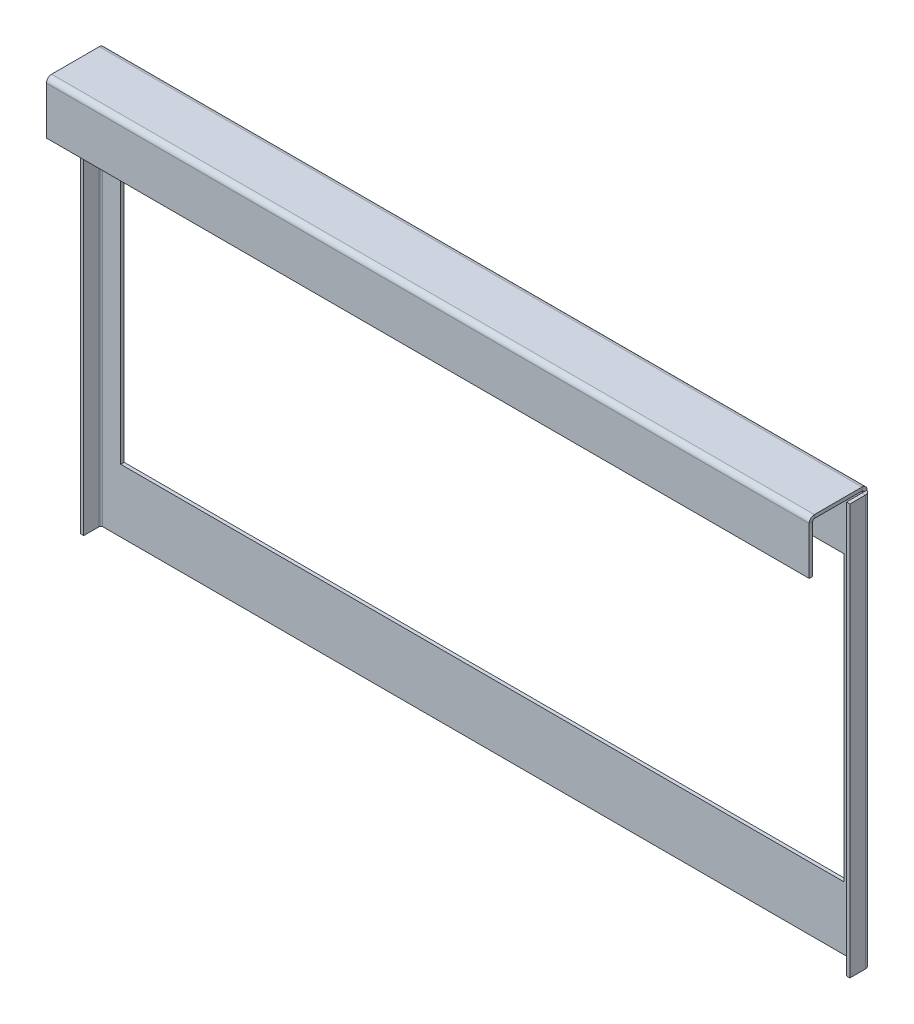
ISO-10303-21;
HEADER;
FILE_DESCRIPTION(('STEP AP214'),'2;1');
FILE_NAME('part.step','',(''),(''),'','','');
FILE_SCHEMA(('AUTOMOTIVE_DESIGN { 1 0 10303 214 1 1 1 1 }'));
ENDSEC;
DATA;
#1=APPLICATION_CONTEXT('core data for automotive mechanical design processes');
#2=APPLICATION_PROTOCOL_DEFINITION('international standard','automotive_design',2000,#1);
#3=PRODUCT_CONTEXT('',#1,'mechanical');
#4=PRODUCT('Part','Part','',(#3));
#5=PRODUCT_RELATED_PRODUCT_CATEGORY('part','',(#4));
#6=PRODUCT_DEFINITION_FORMATION('','',#4);
#7=PRODUCT_DEFINITION_CONTEXT('part definition',#1,'design');
#8=PRODUCT_DEFINITION('design','',#6,#7);
#9=PRODUCT_DEFINITION_SHAPE('','',#8);
#10=(LENGTH_UNIT() NAMED_UNIT(*) SI_UNIT(.MILLI.,.METRE.));
#11=(NAMED_UNIT(*) PLANE_ANGLE_UNIT() SI_UNIT($,.RADIAN.));
#12=(NAMED_UNIT(*) SI_UNIT($,.STERADIAN.) SOLID_ANGLE_UNIT());
#13=UNCERTAINTY_MEASURE_WITH_UNIT(LENGTH_MEASURE(1.E-05),#10,'distance_accuracy_value','');
#14=(GEOMETRIC_REPRESENTATION_CONTEXT(3) GLOBAL_UNCERTAINTY_ASSIGNED_CONTEXT((#13)) GLOBAL_UNIT_ASSIGNED_CONTEXT((#10,
#11,#12)) REPRESENTATION_CONTEXT('',''));
#15=CARTESIAN_POINT('',(0.,0.,0.));
#16=DIRECTION('',(0.,0.,1.));
#17=DIRECTION('',(1.,0.,0.));
#18=AXIS2_PLACEMENT_3D('',#15,#16,#17);
#19=CARTESIAN_POINT('',(221.5,88.4292036732051,0.));
#20=DIRECTION('',(0.,-1.,0.));
#21=DIRECTION('',(0.,0.,-1.));
#22=AXIS2_PLACEMENT_3D('',#19,#20,#21);
#23=PLANE('',#22);
#24=DIRECTION('',(0.,0.,1.));
#25=VECTOR('',#24,1.);
#26=CARTESIAN_POINT('',(221.5,88.4292036732051,-2.00000000000043));
#27=LINE('',#26,#25);
#28=CARTESIAN_POINT('',(221.5,88.4292036732051,-2.));
#29=VERTEX_POINT('',#28);
#30=CARTESIAN_POINT('',(221.5,88.4292036732051,-1.82842712474622));
#31=VERTEX_POINT('',#30);
#32=EDGE_CURVE('E513',#29,#31,#27,.T.);
#33=ORIENTED_EDGE('',*,*,#32,.T.);
#34=CARTESIAN_POINT('',(220.5,88.4292036732051,1.00000000000001));
#35=DIRECTION('',(0.,1.,0.));
#36=DIRECTION('',(0.,0.,1.));
#37=AXIS2_PLACEMENT_3D('',#34,#35,#36);
#38=CIRCLE('',#37,3.00000000000003);
#39=CARTESIAN_POINT('',(220.5,88.4292036732051,-2.));
#40=VERTEX_POINT('',#39);
#41=EDGE_CURVE('E12',#31,#40,#38,.T.);
#42=ORIENTED_EDGE('',*,*,#41,.T.);
#43=DIRECTION('',(-1.,0.,0.));
#44=VECTOR('',#43,1.);
#45=CARTESIAN_POINT('',(0.,88.4292036732051,-2.));
#46=LINE('',#45,#44);
#47=EDGE_CURVE('E522',#29,#40,#46,.T.);
#48=ORIENTED_EDGE('',*,*,#47,.F.);
#49=EDGE_LOOP('',(#33,#42,#48));
#50=FACE_BOUND('',#49,.T.);
#51=ADVANCED_FACE('F46',(#50),#23,.T.);
#52=CARTESIAN_POINT('',(0.,0.,-2.));
#53=DIRECTION('',(0.,0.,1.));
#54=DIRECTION('',(1.,0.,0.));
#55=AXIS2_PLACEMENT_3D('',#52,#53,#54);
#56=PLANE('',#55);
#57=DIRECTION('',(1.,0.,0.));
#58=VECTOR('',#57,1.);
#59=CARTESIAN_POINT('',(-210.,-113.364518484025,-2.00000000000002));
#60=LINE('',#59,#58);
#61=CARTESIAN_POINT('',(-210.,-113.364518484025,-2.00000000000002));
#62=VERTEX_POINT('',#61);
#63=CARTESIAN_POINT('',(210.,-113.364518484025,-2.00000000000002));
#64=VERTEX_POINT('',#63);
#65=EDGE_CURVE('E237',#62,#64,#60,.T.);
#66=ORIENTED_EDGE('',*,*,#65,.T.);
#67=DIRECTION('',(0.,1.,0.));
#68=VECTOR('',#67,1.);
#69=CARTESIAN_POINT('',(210.,51.6354815159748,-2.00000000000002));
#70=LINE('',#69,#68);
#71=CARTESIAN_POINT('',(210.,51.6354815159748,-2.00000000000002));
#72=VERTEX_POINT('',#71);
#73=EDGE_CURVE('E230',#64,#72,#70,.T.);
#74=ORIENTED_EDGE('',*,*,#73,.T.);
#75=DIRECTION('',(-1.,0.,0.));
#76=VECTOR('',#75,1.);
#77=CARTESIAN_POINT('',(-210.,51.6354815159748,-2.00000000000002));
#78=LINE('',#77,#76);
#79=CARTESIAN_POINT('',(-210.,51.6354815159748,-2.));
#80=VERTEX_POINT('',#79);
#81=EDGE_CURVE('E240',#72,#80,#78,.T.);
#82=ORIENTED_EDGE('',*,*,#81,.T.);
#83=DIRECTION('',(0.,-1.,0.));
#84=VECTOR('',#83,1.);
#85=CARTESIAN_POINT('',(-210.,51.6354815159748,-2.00000000000002));
#86=LINE('',#85,#84);
#87=EDGE_CURVE('E65',#80,#62,#86,.T.);
#88=ORIENTED_EDGE('',*,*,#87,.T.);
#89=EDGE_LOOP('',(#66,#74,#82,#88));
#90=FACE_BOUND('',#89,.T.);
#91=DIRECTION('',(0.,1.,0.));
#92=VECTOR('',#91,1.);
#93=CARTESIAN_POINT('',(220.5,88.4292036732051,-2.00000000000002));
#94=LINE('',#93,#92);
#95=CARTESIAN_POINT('',(220.5,-150.,-2.));
#96=VERTEX_POINT('',#95);
#97=EDGE_CURVE('E320',#40,#96,#94,.F.);
#98=ORIENTED_EDGE('',*,*,#97,.T.);
#99=DIRECTION('',(1.,0.,0.));
#100=VECTOR('',#99,1.);
#101=CARTESIAN_POINT('',(-221.5,-150.,-2.));
#102=LINE('',#101,#100);
#103=CARTESIAN_POINT('',(-220.5,-150.,-2.));
#104=VERTEX_POINT('',#103);
#105=EDGE_CURVE('E518',#104,#96,#102,.T.);
#106=ORIENTED_EDGE('',*,*,#105,.F.);
#107=DIRECTION('',(0.,-1.,0.));
#108=VECTOR('',#107,1.);
#109=CARTESIAN_POINT('',(-220.5,-150.,-1.99999999999999));
#110=LINE('',#109,#108);
#111=CARTESIAN_POINT('',(-220.5,88.4292036732051,-2.));
#112=VERTEX_POINT('',#111);
#113=EDGE_CURVE('E388',#104,#112,#110,.F.);
#114=ORIENTED_EDGE('',*,*,#113,.T.);
#115=EDGE_CURVE('E492',#40,#112,#46,.T.);
#116=ORIENTED_EDGE('',*,*,#115,.F.);
#117=EDGE_LOOP('',(#98,#106,#114,#116));
#118=FACE_BOUND('',#117,.T.);
#119=ADVANCED_FACE('F245',(#90,#118),#56,.F.);
#120=CARTESIAN_POINT('',(0.,0.,0.));
#121=DIRECTION('',(0.,0.,1.));
#122=DIRECTION('',(1.,0.,0.));
#123=AXIS2_PLACEMENT_3D('',#120,#121,#122);
#124=PLANE('',#123);
#125=DIRECTION('',(0.,1.,0.));
#126=VECTOR('',#125,1.);
#127=CARTESIAN_POINT('',(210.,51.6354815159748,0.));
#128=LINE('',#127,#126);
#129=CARTESIAN_POINT('',(210.,-113.364518484025,0.));
#130=VERTEX_POINT('',#129);
#131=CARTESIAN_POINT('',(210.,51.6354815159748,0.));
#132=VERTEX_POINT('',#131);
#133=EDGE_CURVE('E73',#130,#132,#128,.T.);
#134=ORIENTED_EDGE('',*,*,#133,.F.);
#135=DIRECTION('',(1.,0.,0.));
#136=VECTOR('',#135,1.);
#137=CARTESIAN_POINT('',(-210.,-113.364518484025,0.));
#138=LINE('',#137,#136);
#139=CARTESIAN_POINT('',(-210.,-113.364518484025,0.));
#140=VERTEX_POINT('',#139);
#141=EDGE_CURVE('E249',#140,#130,#138,.T.);
#142=ORIENTED_EDGE('',*,*,#141,.F.);
#143=DIRECTION('',(0.,-1.,0.));
#144=VECTOR('',#143,1.);
#145=CARTESIAN_POINT('',(-210.,51.6354815159748,0.));
#146=LINE('',#145,#144);
#147=CARTESIAN_POINT('',(-210.,51.6354815159748,0.));
#148=VERTEX_POINT('',#147);
#149=EDGE_CURVE('E254',#148,#140,#146,.T.);
#150=ORIENTED_EDGE('',*,*,#149,.F.);
#151=DIRECTION('',(-1.,0.,0.));
#152=VECTOR('',#151,1.);
#153=CARTESIAN_POINT('',(-210.,51.6354815159748,0.));
#154=LINE('',#153,#152);
#155=EDGE_CURVE('E263',#132,#148,#154,.T.);
#156=ORIENTED_EDGE('',*,*,#155,.F.);
#157=EDGE_LOOP('',(#134,#142,#150,#156));
#158=FACE_BOUND('',#157,.T.);
#159=DIRECTION('',(1.,0.,0.));
#160=VECTOR('',#159,1.);
#161=CARTESIAN_POINT('',(-221.5,-150.,0.));
#162=LINE('',#161,#160);
#163=CARTESIAN_POINT('',(-220.5,-150.,0.));
#164=VERTEX_POINT('',#163);
#165=CARTESIAN_POINT('',(220.5,-150.,0.));
#166=VERTEX_POINT('',#165);
#167=EDGE_CURVE('E504',#164,#166,#162,.T.);
#168=ORIENTED_EDGE('',*,*,#167,.T.);
#169=DIRECTION('',(0.,1.,0.));
#170=VECTOR('',#169,1.);
#171=CARTESIAN_POINT('',(220.5,88.4292036732051,0.));
#172=LINE('',#171,#170);
#173=CARTESIAN_POINT('',(220.5,88.4292036732051,0.));
#174=VERTEX_POINT('',#173);
#175=EDGE_CURVE('E334',#174,#166,#172,.F.);
#176=ORIENTED_EDGE('',*,*,#175,.F.);
#177=DIRECTION('',(-1.,0.,0.));
#178=VECTOR('',#177,1.);
#179=CARTESIAN_POINT('',(0.,88.4292036732051,0.));
#180=LINE('',#179,#178);
#181=CARTESIAN_POINT('',(-220.5,88.4292036732051,0.));
#182=VERTEX_POINT('',#181);
#183=EDGE_CURVE('E512',#174,#182,#180,.T.);
#184=ORIENTED_EDGE('',*,*,#183,.T.);
#185=DIRECTION('',(0.,-1.,0.));
#186=VECTOR('',#185,1.);
#187=CARTESIAN_POINT('',(-220.5,-150.,0.));
#188=LINE('',#187,#186);
#189=EDGE_CURVE('E406',#164,#182,#188,.F.);
#190=ORIENTED_EDGE('',*,*,#189,.F.);
#191=EDGE_LOOP('',(#168,#176,#184,#190));
#192=FACE_BOUND('',#191,.T.);
#193=ADVANCED_FACE('F720',(#158,#192),#124,.T.);
#194=CARTESIAN_POINT('',(-220.5,88.4292036732051,0.));
#195=DIRECTION('',(0.,-1.,0.));
#196=DIRECTION('',(0.,0.,-1.));
#197=AXIS2_PLACEMENT_3D('',#194,#195,#196);
#198=PLANE('',#197);
#199=DIRECTION('',(1.,0.,0.));
#200=VECTOR('',#199,1.);
#201=CARTESIAN_POINT('',(-443.015653904465,88.4292036732051,-2.));
#202=LINE('',#201,#200);
#203=CARTESIAN_POINT('',(-221.5,88.4292036732051,-2.));
#204=VERTEX_POINT('',#203);
#205=EDGE_CURVE('E419',#112,#204,#202,.F.);
#206=ORIENTED_EDGE('',*,*,#205,.F.);
#207=CARTESIAN_POINT('',(-220.5,88.4292036732051,1.00000000000001));
#208=DIRECTION('',(0.,-1.,0.));
#209=DIRECTION('',(0.,0.,-1.));
#210=AXIS2_PLACEMENT_3D('',#207,#208,#209);
#211=CIRCLE('',#210,3.);
#212=CARTESIAN_POINT('',(-221.5,88.4292036732051,-1.82842712474617));
#213=VERTEX_POINT('',#212);
#214=EDGE_CURVE('E394',#112,#213,#211,.F.);
#215=ORIENTED_EDGE('',*,*,#214,.T.);
#216=DIRECTION('',(0.,0.,-1.));
#217=VECTOR('',#216,1.);
#218=CARTESIAN_POINT('',(-221.5,88.4292036732051,-2.00000000000043));
#219=LINE('',#218,#217);
#220=EDGE_CURVE('E503',#213,#204,#219,.T.);
#221=ORIENTED_EDGE('',*,*,#220,.T.);
#222=EDGE_LOOP('',(#206,#215,#221));
#223=FACE_BOUND('',#222,.T.);
#224=ADVANCED_FACE('F627',(#223),#198,.T.);
#225=CARTESIAN_POINT('',(-221.5,-150.,-2.));
#226=DIRECTION('',(0.,-1.,0.));
#227=DIRECTION('',(0.,0.,-1.));
#228=AXIS2_PLACEMENT_3D('',#225,#226,#227);
#229=PLANE('',#228);
#230=DIRECTION('',(0.,0.,-1.));
#231=VECTOR('',#230,1.);
#232=CARTESIAN_POINT('',(220.5,-150.,0.));
#233=LINE('',#232,#231);
#234=EDGE_CURVE('E326',#166,#96,#233,.T.);
#235=ORIENTED_EDGE('',*,*,#234,.F.);
#236=ORIENTED_EDGE('',*,*,#167,.F.);
#237=DIRECTION('',(0.,0.,-1.));
#238=VECTOR('',#237,1.);
#239=CARTESIAN_POINT('',(-220.5,-150.,0.));
#240=LINE('',#239,#238);
#241=EDGE_CURVE('E398',#164,#104,#240,.T.);
#242=ORIENTED_EDGE('',*,*,#241,.T.);
#243=ORIENTED_EDGE('',*,*,#105,.T.);
#244=EDGE_LOOP('',(#235,#236,#242,#243));
#245=FACE_BOUND('',#244,.T.);
#246=ADVANCED_FACE('F831',(#245),#229,.T.);
#247=CARTESIAN_POINT('',(0.,91.4292036732054,-90.5707963267948));
#248=DIRECTION('',(0.,-1.,0.));
#249=DIRECTION('',(1.,0.,0.));
#250=AXIS2_PLACEMENT_3D('',#247,#248,#249);
#251=PLANE('',#250);
#252=DIRECTION('',(0.,0.,-1.));
#253=VECTOR('',#252,1.);
#254=CARTESIAN_POINT('',(-221.5,91.4292036732048,59.4292036732051));
#255=LINE('',#254,#253);
#256=CARTESIAN_POINT('',(-221.5,91.429203673205,28.6438055098077));
#257=VERTEX_POINT('',#256);
#258=CARTESIAN_POINT('',(-221.5,91.4292036732051,0.999999999999997));
#259=VERTEX_POINT('',#258);
#260=EDGE_CURVE('E50',#257,#259,#255,.T.);
#261=ORIENTED_EDGE('',*,*,#260,.F.);
#262=DIRECTION('',(1.,0.,0.));
#263=VECTOR('',#262,1.);
#264=CARTESIAN_POINT('',(0.,91.429203673205,28.6438055098077));
#265=LINE('',#264,#263);
#266=CARTESIAN_POINT('',(221.5,91.429203673205,28.6438055098077));
#267=VERTEX_POINT('',#266);
#268=EDGE_CURVE('E542',#257,#267,#265,.T.);
#269=ORIENTED_EDGE('',*,*,#268,.T.);
#270=DIRECTION('',(0.,0.,1.));
#271=VECTOR('',#270,1.);
#272=CARTESIAN_POINT('',(221.5,91.4292036732048,59.4292036732051));
#273=LINE('',#272,#271);
#274=CARTESIAN_POINT('',(221.5,91.4292036732051,1.00000000000001));
#275=VERTEX_POINT('',#274);
#276=EDGE_CURVE('E557',#275,#267,#273,.T.);
#277=ORIENTED_EDGE('',*,*,#276,.F.);
#278=DIRECTION('',(-1.,0.,0.));
#279=VECTOR('',#278,1.);
#280=CARTESIAN_POINT('',(0.,91.4292036732051,1.00000000000001));
#281=LINE('',#280,#279);
#282=EDGE_CURVE('E526',#275,#259,#281,.T.);
#283=ORIENTED_EDGE('',*,*,#282,.T.);
#284=EDGE_LOOP('',(#261,#269,#277,#283));
#285=FACE_BOUND('',#284,.T.);
#286=ADVANCED_FACE('F607',(#285),#251,.F.);
#287=CARTESIAN_POINT('',(221.5,91.4292036732048,59.4292036732051));
#288=DIRECTION('',(1.,0.,0.));
#289=DIRECTION('',(0.,0.,1.));
#290=AXIS2_PLACEMENT_3D('',#287,#288,#289);
#291=PLANE('',#290);
#292=DIRECTION('',(0.,1.,0.));
#293=VECTOR('',#292,1.);
#294=CARTESIAN_POINT('',(221.5,91.429203673205,28.6438055098077));
#295=LINE('',#294,#293);
#296=CARTESIAN_POINT('',(221.5,89.429203673205,28.6438055098077));
#297=VERTEX_POINT('',#296);
#298=EDGE_CURVE('E56',#297,#267,#295,.T.);
#299=ORIENTED_EDGE('',*,*,#298,.F.);
#300=DIRECTION('',(0.,0.,1.));
#301=VECTOR('',#300,1.);
#302=CARTESIAN_POINT('',(221.5,89.4292036732048,59.4292036732051));
#303=LINE('',#302,#301);
#304=CARTESIAN_POINT('',(221.5,89.4292036732051,0.999999999999987));
#305=VERTEX_POINT('',#304);
#306=EDGE_CURVE('E502',#305,#297,#303,.T.);
#307=ORIENTED_EDGE('',*,*,#306,.F.);
#308=DIRECTION('',(0.,-1.,0.));
#309=VECTOR('',#308,1.);
#310=CARTESIAN_POINT('',(221.5,91.4292036732054,1.00000000000001));
#311=LINE('',#310,#309);
#312=EDGE_CURVE('E530',#275,#305,#311,.T.);
#313=ORIENTED_EDGE('',*,*,#312,.F.);
#314=ORIENTED_EDGE('',*,*,#276,.T.);
#315=EDGE_LOOP('',(#299,#307,#313,#314));
#316=FACE_BOUND('',#315,.T.);
#317=ADVANCED_FACE('F48',(#316),#291,.T.);
#318=CARTESIAN_POINT('',(-221.5,91.4292036732048,59.4292036732051));
#319=DIRECTION('',(-1.,0.,0.));
#320=DIRECTION('',(0.,0.,-1.));
#321=AXIS2_PLACEMENT_3D('',#318,#319,#320);
#322=PLANE('',#321);
#323=DIRECTION('',(0.,-1.,0.));
#324=VECTOR('',#323,1.);
#325=CARTESIAN_POINT('',(-221.5,91.429203673205,28.6438055098077));
#326=LINE('',#325,#324);
#327=CARTESIAN_POINT('',(-221.5,89.429203673205,28.6438055098077));
#328=VERTEX_POINT('',#327);
#329=EDGE_CURVE('E546',#257,#328,#326,.T.);
#330=ORIENTED_EDGE('',*,*,#329,.F.);
#331=ORIENTED_EDGE('',*,*,#260,.T.);
#332=DIRECTION('',(0.,1.,0.));
#333=VECTOR('',#332,1.);
#334=CARTESIAN_POINT('',(-221.5,91.4292036732054,1.00000000000001));
#335=LINE('',#334,#333);
#336=CARTESIAN_POINT('',(-221.5,89.4292036732051,0.999999999999987));
#337=VERTEX_POINT('',#336);
#338=EDGE_CURVE('E538',#337,#259,#335,.T.);
#339=ORIENTED_EDGE('',*,*,#338,.F.);
#340=DIRECTION('',(0.,0.,-1.));
#341=VECTOR('',#340,1.);
#342=CARTESIAN_POINT('',(-221.5,89.4292036732048,59.4292036732051));
#343=LINE('',#342,#341);
#344=EDGE_CURVE('E560',#328,#337,#343,.T.);
#345=ORIENTED_EDGE('',*,*,#344,.F.);
#346=EDGE_LOOP('',(#330,#331,#339,#345));
#347=FACE_BOUND('',#346,.T.);
#348=ADVANCED_FACE('F571',(#347),#322,.T.);
#349=CARTESIAN_POINT('',(0.,89.4292036732054,-90.5707963267948));
#350=DIRECTION('',(0.,-1.,0.));
#351=DIRECTION('',(1.,0.,0.));
#352=AXIS2_PLACEMENT_3D('',#349,#350,#351);
#353=PLANE('',#352);
#354=DIRECTION('',(1.,0.,0.));
#355=VECTOR('',#354,1.);
#356=CARTESIAN_POINT('',(0.,89.429203673205,28.6438055098077));
#357=LINE('',#356,#355);
#358=EDGE_CURVE('E550',#328,#297,#357,.T.);
#359=ORIENTED_EDGE('',*,*,#358,.F.);
#360=ORIENTED_EDGE('',*,*,#344,.T.);
#361=DIRECTION('',(-1.,0.,0.));
#362=VECTOR('',#361,1.);
#363=CARTESIAN_POINT('',(0.,89.4292036732051,0.999999999999987));
#364=LINE('',#363,#362);
#365=EDGE_CURVE('E534',#305,#337,#364,.T.);
#366=ORIENTED_EDGE('',*,*,#365,.F.);
#367=ORIENTED_EDGE('',*,*,#306,.T.);
#368=EDGE_LOOP('',(#359,#360,#366,#367));
#369=FACE_BOUND('',#368,.T.);
#370=ADVANCED_FACE('F568',(#369),#353,.T.);
#371=CARTESIAN_POINT('',(221.5,88.4292036732051,1.));
#372=DIRECTION('',(1.,0.,0.));
#373=DIRECTION('',(0.,0.,-1.));
#374=AXIS2_PLACEMENT_3D('',#371,#372,#373);
#375=PLANE('',#374);
#376=ORIENTED_EDGE('',*,*,#312,.T.);
#377=CARTESIAN_POINT('',(221.5,88.4292036732051,1.));
#378=DIRECTION('',(1.,0.,0.));
#379=DIRECTION('',(0.,0.,-1.));
#380=AXIS2_PLACEMENT_3D('',#377,#378,#379);
#381=CIRCLE('',#380,1.);
#382=CARTESIAN_POINT('',(221.5,88.4292036732051,0.));
#383=VERTEX_POINT('',#382);
#384=EDGE_CURVE('E476',#305,#383,#381,.F.);
#385=ORIENTED_EDGE('',*,*,#384,.T.);
#386=EDGE_CURVE('E517',#31,#383,#27,.T.);
#387=ORIENTED_EDGE('',*,*,#386,.F.);
#388=ORIENTED_EDGE('',*,*,#32,.F.);
#389=CARTESIAN_POINT('',(221.5,88.4292036732051,1.));
#390=DIRECTION('',(-1.,0.,0.));
#391=DIRECTION('',(0.,0.,-1.));
#392=AXIS2_PLACEMENT_3D('',#389,#390,#391);
#393=CIRCLE('',#392,3.);
#394=EDGE_CURVE('E483',#275,#29,#393,.T.);
#395=ORIENTED_EDGE('',*,*,#394,.F.);
#396=EDGE_LOOP('',(#376,#385,#387,#388,#395));
#397=FACE_BOUND('',#396,.T.);
#398=ADVANCED_FACE('F584',(#397),#375,.T.);
#399=CARTESIAN_POINT('',(-221.5,88.4292036732051,1.));
#400=DIRECTION('',(-1.,0.,0.));
#401=DIRECTION('',(0.,0.,1.));
#402=AXIS2_PLACEMENT_3D('',#399,#400,#401);
#403=PLANE('',#402);
#404=CARTESIAN_POINT('',(-221.5,88.4292036732051,0.));
#405=VERTEX_POINT('',#404);
#406=EDGE_CURVE('E498',#405,#213,#219,.T.);
#407=ORIENTED_EDGE('',*,*,#406,.F.);
#408=CARTESIAN_POINT('',(-221.5,88.4292036732051,1.));
#409=DIRECTION('',(1.,0.,0.));
#410=DIRECTION('',(0.,0.,-1.));
#411=AXIS2_PLACEMENT_3D('',#408,#409,#410);
#412=CIRCLE('',#411,1.);
#413=EDGE_CURVE('E488',#405,#337,#412,.T.);
#414=ORIENTED_EDGE('',*,*,#413,.T.);
#415=ORIENTED_EDGE('',*,*,#338,.T.);
#416=CARTESIAN_POINT('',(-221.5,88.4292036732051,1.));
#417=DIRECTION('',(1.,0.,0.));
#418=DIRECTION('',(0.,0.,1.));
#419=AXIS2_PLACEMENT_3D('',#416,#417,#418);
#420=CIRCLE('',#419,3.);
#421=EDGE_CURVE('E487',#204,#259,#420,.T.);
#422=ORIENTED_EDGE('',*,*,#421,.F.);
#423=ORIENTED_EDGE('',*,*,#220,.F.);
#424=EDGE_LOOP('',(#407,#414,#415,#422,#423));
#425=FACE_BOUND('',#424,.T.);
#426=ADVANCED_FACE('F575',(#425),#403,.T.);
#427=CARTESIAN_POINT('',(-443.015653904465,88.4292036732051,1.));
#428=DIRECTION('',(1.,0.,0.));
#429=DIRECTION('',(0.,0.,-1.));
#430=AXIS2_PLACEMENT_3D('',#427,#428,#429);
#431=CYLINDRICAL_SURFACE('',#430,3.);
#432=ORIENTED_EDGE('',*,*,#421,.T.);
#433=ORIENTED_EDGE('',*,*,#282,.F.);
#434=ORIENTED_EDGE('',*,*,#394,.T.);
#435=ORIENTED_EDGE('',*,*,#47,.T.);
#436=ORIENTED_EDGE('',*,*,#115,.T.);
#437=ORIENTED_EDGE('',*,*,#205,.T.);
#438=EDGE_LOOP('',(#432,#433,#434,#435,#436,#437));
#439=FACE_BOUND('',#438,.T.);
#440=ADVANCED_FACE('F621',(#439),#431,.T.);
#441=CARTESIAN_POINT('',(-443.015653904465,88.4292036732051,1.));
#442=DIRECTION('',(1.,0.,0.));
#443=DIRECTION('',(0.,0.,-1.));
#444=AXIS2_PLACEMENT_3D('',#441,#442,#443);
#445=CYLINDRICAL_SURFACE('',#444,1.);
#446=ORIENTED_EDGE('',*,*,#413,.F.);
#447=DIRECTION('',(-1.,0.,0.));
#448=VECTOR('',#447,1.);
#449=CARTESIAN_POINT('',(-220.5,88.4292036732051,0.));
#450=LINE('',#449,#448);
#451=EDGE_CURVE('E415',#182,#405,#450,.T.);
#452=ORIENTED_EDGE('',*,*,#451,.F.);
#453=ORIENTED_EDGE('',*,*,#183,.F.);
#454=EDGE_CURVE('E508',#383,#174,#180,.T.);
#455=ORIENTED_EDGE('',*,*,#454,.F.);
#456=ORIENTED_EDGE('',*,*,#384,.F.);
#457=ORIENTED_EDGE('',*,*,#365,.T.);
#458=EDGE_LOOP('',(#446,#452,#453,#455,#456,#457));
#459=FACE_BOUND('',#458,.T.);
#460=ADVANCED_FACE('F579',(#459),#445,.F.);
#461=CARTESIAN_POINT('',(-221.5,88.429203673205,28.6438055098077));
#462=DIRECTION('',(-1.,0.,0.));
#463=DIRECTION('',(0.,0.,1.));
#464=AXIS2_PLACEMENT_3D('',#461,#462,#463);
#465=PLANE('',#464);
#466=ORIENTED_EDGE('',*,*,#329,.T.);
#467=CARTESIAN_POINT('',(-221.5,88.429203673205,28.6438055098077));
#468=DIRECTION('',(1.,0.,0.));
#469=DIRECTION('',(0.,0.,-1.));
#470=AXIS2_PLACEMENT_3D('',#467,#468,#469);
#471=CIRCLE('',#470,1.);
#472=CARTESIAN_POINT('',(-221.5,88.4292036732049,29.6438055098077));
#473=VERTEX_POINT('',#472);
#474=EDGE_CURVE('E428',#328,#473,#471,.T.);
#475=ORIENTED_EDGE('',*,*,#474,.T.);
#476=DIRECTION('',(0.,0.,-1.));
#477=VECTOR('',#476,1.);
#478=CARTESIAN_POINT('',(-221.5,88.4292036732049,31.6438055098077));
#479=LINE('',#478,#477);
#480=CARTESIAN_POINT('',(-221.5,88.4292036732049,31.6438055098077));
#481=VERTEX_POINT('',#480);
#482=EDGE_CURVE('E449',#481,#473,#479,.T.);
#483=ORIENTED_EDGE('',*,*,#482,.F.);
#484=CARTESIAN_POINT('',(-221.5,88.429203673205,28.6438055098077));
#485=DIRECTION('',(1.,0.,0.));
#486=DIRECTION('',(0.,0.,1.));
#487=AXIS2_PLACEMENT_3D('',#484,#485,#486);
#488=CIRCLE('',#487,3.);
#489=EDGE_CURVE('E467',#257,#481,#488,.T.);
#490=ORIENTED_EDGE('',*,*,#489,.F.);
#491=EDGE_LOOP('',(#466,#475,#483,#490));
#492=FACE_BOUND('',#491,.T.);
#493=ADVANCED_FACE('F601',(#492),#465,.T.);
#494=CARTESIAN_POINT('',(221.5,88.429203673205,28.6438055098077));
#495=DIRECTION('',(1.,0.,0.));
#496=DIRECTION('',(0.,0.,-1.));
#497=AXIS2_PLACEMENT_3D('',#494,#495,#496);
#498=PLANE('',#497);
#499=DIRECTION('',(0.,0.,1.));
#500=VECTOR('',#499,1.);
#501=CARTESIAN_POINT('',(221.5,88.4292036732049,31.6438055098077));
#502=LINE('',#501,#500);
#503=CARTESIAN_POINT('',(221.5,88.4292036732049,29.6438055098077));
#504=VERTEX_POINT('',#503);
#505=CARTESIAN_POINT('',(221.5,88.4292036732049,31.6438055098077));
#506=VERTEX_POINT('',#505);
#507=EDGE_CURVE('E432',#504,#506,#502,.T.);
#508=ORIENTED_EDGE('',*,*,#507,.F.);
#509=CARTESIAN_POINT('',(221.5,88.429203673205,28.6438055098077));
#510=DIRECTION('',(1.,0.,0.));
#511=DIRECTION('',(0.,0.,-1.));
#512=AXIS2_PLACEMENT_3D('',#509,#510,#511);
#513=CIRCLE('',#512,1.);
#514=EDGE_CURVE('E472',#504,#297,#513,.F.);
#515=ORIENTED_EDGE('',*,*,#514,.T.);
#516=ORIENTED_EDGE('',*,*,#298,.T.);
#517=CARTESIAN_POINT('',(221.5,88.429203673205,28.6438055098077));
#518=DIRECTION('',(-1.,0.,0.));
#519=DIRECTION('',(0.,0.,-1.));
#520=AXIS2_PLACEMENT_3D('',#517,#518,#519);
#521=CIRCLE('',#520,3.);
#522=EDGE_CURVE('E471',#506,#267,#521,.T.);
#523=ORIENTED_EDGE('',*,*,#522,.F.);
#524=EDGE_LOOP('',(#508,#515,#516,#523));
#525=FACE_BOUND('',#524,.T.);
#526=ADVANCED_FACE('F594',(#525),#498,.T.);
#527=CARTESIAN_POINT('',(-443.015653904465,88.429203673205,28.6438055098077));
#528=DIRECTION('',(1.,0.,0.));
#529=DIRECTION('',(0.,0.,-1.));
#530=AXIS2_PLACEMENT_3D('',#527,#528,#529);
#531=CYLINDRICAL_SURFACE('',#530,3.);
#532=ORIENTED_EDGE('',*,*,#522,.T.);
#533=ORIENTED_EDGE('',*,*,#268,.F.);
#534=ORIENTED_EDGE('',*,*,#489,.T.);
#535=DIRECTION('',(1.,0.,0.));
#536=VECTOR('',#535,1.);
#537=CARTESIAN_POINT('',(0.,88.4292036732049,31.6438055098077));
#538=LINE('',#537,#536);
#539=EDGE_CURVE('E423',#481,#506,#538,.T.);
#540=ORIENTED_EDGE('',*,*,#539,.T.);
#541=EDGE_LOOP('',(#532,#533,#534,#540));
#542=FACE_BOUND('',#541,.T.);
#543=ADVANCED_FACE('F605',(#542),#531,.T.);
#544=CARTESIAN_POINT('',(-443.015653904465,88.429203673205,28.6438055098077));
#545=DIRECTION('',(1.,0.,0.));
#546=DIRECTION('',(0.,0.,-1.));
#547=AXIS2_PLACEMENT_3D('',#544,#545,#546);
#548=CYLINDRICAL_SURFACE('',#547,1.);
#549=ORIENTED_EDGE('',*,*,#514,.F.);
#550=DIRECTION('',(1.,0.,0.));
#551=VECTOR('',#550,1.);
#552=CARTESIAN_POINT('',(0.,88.429203673205,29.6438055098077));
#553=LINE('',#552,#551);
#554=EDGE_CURVE('E442',#473,#504,#553,.T.);
#555=ORIENTED_EDGE('',*,*,#554,.F.);
#556=ORIENTED_EDGE('',*,*,#474,.F.);
#557=ORIENTED_EDGE('',*,*,#358,.T.);
#558=EDGE_LOOP('',(#549,#555,#556,#557));
#559=FACE_BOUND('',#558,.T.);
#560=ADVANCED_FACE('F598',(#559),#548,.F.);
#561=CARTESIAN_POINT('',(-221.5,60.7853981633974,31.6438055098075));
#562=DIRECTION('',(0.,-1.,0.));
#563=DIRECTION('',(0.,0.,-1.));
#564=AXIS2_PLACEMENT_3D('',#561,#562,#563);
#565=PLANE('',#564);
#566=DIRECTION('',(-1.,0.,0.));
#567=VECTOR('',#566,1.);
#568=CARTESIAN_POINT('',(-221.5,60.7853981633974,29.6438055098075));
#569=LINE('',#568,#567);
#570=CARTESIAN_POINT('',(221.5,60.7853981633974,29.6438055098075));
#571=VERTEX_POINT('',#570);
#572=CARTESIAN_POINT('',(-221.5,60.7853981633974,29.6438055098075));
#573=VERTEX_POINT('',#572);
#574=EDGE_CURVE('E435',#571,#573,#569,.T.);
#575=ORIENTED_EDGE('',*,*,#574,.F.);
#576=DIRECTION('',(0.,0.,-1.));
#577=VECTOR('',#576,1.);
#578=CARTESIAN_POINT('',(221.5,60.7853981633974,31.6438055098075));
#579=LINE('',#578,#577);
#580=CARTESIAN_POINT('',(221.5,60.7853981633974,31.6438055098075));
#581=VERTEX_POINT('',#580);
#582=EDGE_CURVE('E424',#581,#571,#579,.T.);
#583=ORIENTED_EDGE('',*,*,#582,.F.);
#584=DIRECTION('',(-1.,0.,0.));
#585=VECTOR('',#584,1.);
#586=CARTESIAN_POINT('',(-221.5,60.7853981633974,31.6438055098075));
#587=LINE('',#586,#585);
#588=CARTESIAN_POINT('',(-221.5,60.7853981633974,31.6438055098075));
#589=VERTEX_POINT('',#588);
#590=EDGE_CURVE('E460',#581,#589,#587,.T.);
#591=ORIENTED_EDGE('',*,*,#590,.T.);
#592=DIRECTION('',(0.,0.,-1.));
#593=VECTOR('',#592,1.);
#594=CARTESIAN_POINT('',(-221.5,60.7853981633974,31.6438055098075));
#595=LINE('',#594,#593);
#596=EDGE_CURVE('E457',#589,#573,#595,.T.);
#597=ORIENTED_EDGE('',*,*,#596,.T.);
#598=EDGE_LOOP('',(#575,#583,#591,#597));
#599=FACE_BOUND('',#598,.T.);
#600=ADVANCED_FACE('F950',(#599),#565,.T.);
#601=CARTESIAN_POINT('',(0.,210.785398163397,31.6438055098086));
#602=DIRECTION('',(0.,0.,-1.));
#603=DIRECTION('',(1.,0.,0.));
#604=AXIS2_PLACEMENT_3D('',#601,#602,#603);
#605=PLANE('',#604);
#606=ORIENTED_EDGE('',*,*,#539,.F.);
#607=DIRECTION('',(0.,1.,0.));
#608=VECTOR('',#607,1.);
#609=CARTESIAN_POINT('',(-221.5,60.7853981633974,31.6438055098075));
#610=LINE('',#609,#608);
#611=EDGE_CURVE('E453',#589,#481,#610,.T.);
#612=ORIENTED_EDGE('',*,*,#611,.F.);
#613=ORIENTED_EDGE('',*,*,#590,.F.);
#614=DIRECTION('',(0.,-1.,0.));
#615=VECTOR('',#614,1.);
#616=CARTESIAN_POINT('',(221.5,60.7853981633974,31.6438055098075));
#617=LINE('',#616,#615);
#618=EDGE_CURVE('E429',#506,#581,#617,.T.);
#619=ORIENTED_EDGE('',*,*,#618,.F.);
#620=EDGE_LOOP('',(#606,#612,#613,#619));
#621=FACE_BOUND('',#620,.T.);
#622=ADVANCED_FACE('F959',(#621),#605,.F.);
#623=CARTESIAN_POINT('',(-221.5,60.7853981633974,31.6438055098075));
#624=DIRECTION('',(-1.,0.,0.));
#625=DIRECTION('',(0.,1.,0.));
#626=AXIS2_PLACEMENT_3D('',#623,#624,#625);
#627=PLANE('',#626);
#628=ORIENTED_EDGE('',*,*,#611,.T.);
#629=ORIENTED_EDGE('',*,*,#482,.T.);
#630=DIRECTION('',(0.,1.,0.));
#631=VECTOR('',#630,1.);
#632=CARTESIAN_POINT('',(-221.5,60.7853981633974,29.6438055098075));
#633=LINE('',#632,#631);
#634=EDGE_CURVE('E446',#573,#473,#633,.T.);
#635=ORIENTED_EDGE('',*,*,#634,.F.);
#636=ORIENTED_EDGE('',*,*,#596,.F.);
#637=EDGE_LOOP('',(#628,#629,#635,#636));
#638=FACE_BOUND('',#637,.T.);
#639=ADVANCED_FACE('F969',(#638),#627,.T.);
#640=CARTESIAN_POINT('',(0.,210.785398163397,29.6438055098086));
#641=DIRECTION('',(0.,0.,-1.));
#642=DIRECTION('',(1.,0.,0.));
#643=AXIS2_PLACEMENT_3D('',#640,#641,#642);
#644=PLANE('',#643);
#645=ORIENTED_EDGE('',*,*,#634,.T.);
#646=ORIENTED_EDGE('',*,*,#554,.T.);
#647=DIRECTION('',(0.,-1.,0.));
#648=VECTOR('',#647,1.);
#649=CARTESIAN_POINT('',(221.5,60.7853981633974,29.6438055098075));
#650=LINE('',#649,#648);
#651=EDGE_CURVE('E439',#504,#571,#650,.T.);
#652=ORIENTED_EDGE('',*,*,#651,.T.);
#653=ORIENTED_EDGE('',*,*,#574,.T.);
#654=EDGE_LOOP('',(#645,#646,#652,#653));
#655=FACE_BOUND('',#654,.T.);
#656=ADVANCED_FACE('F979',(#655),#644,.T.);
#657=CARTESIAN_POINT('',(221.5,60.7853981633974,31.6438055098075));
#658=DIRECTION('',(1.,0.,0.));
#659=DIRECTION('',(0.,-1.,0.));
#660=AXIS2_PLACEMENT_3D('',#657,#658,#659);
#661=PLANE('',#660);
#662=ORIENTED_EDGE('',*,*,#651,.F.);
#663=ORIENTED_EDGE('',*,*,#507,.T.);
#664=ORIENTED_EDGE('',*,*,#618,.T.);
#665=ORIENTED_EDGE('',*,*,#582,.T.);
#666=EDGE_LOOP('',(#662,#663,#664,#665));
#667=FACE_BOUND('',#666,.T.);
#668=ADVANCED_FACE('F989',(#667),#661,.T.);
#669=CARTESIAN_POINT('',(-220.5,88.4292036732051,1.00000000000001));
#670=DIRECTION('',(0.,1.,0.));
#671=DIRECTION('',(0.,0.,1.));
#672=AXIS2_PLACEMENT_3D('',#669,#670,#671);
#673=PLANE('',#672);
#674=CARTESIAN_POINT('',(-220.5,88.4292036732051,1.00000000000001));
#675=DIRECTION('',(0.,-1.,0.));
#676=DIRECTION('',(0.,0.,-1.));
#677=AXIS2_PLACEMENT_3D('',#674,#675,#676);
#678=CIRCLE('',#677,1.);
#679=CARTESIAN_POINT('',(-221.5,88.4292036732051,1.));
#680=VERTEX_POINT('',#679);
#681=EDGE_CURVE('E402',#182,#680,#678,.F.);
#682=ORIENTED_EDGE('',*,*,#681,.F.);
#683=ORIENTED_EDGE('',*,*,#451,.T.);
#684=ORIENTED_EDGE('',*,*,#406,.T.);
#685=CARTESIAN_POINT('',(-223.5,88.4292036732051,0.999999999999989));
#686=VERTEX_POINT('',#685);
#687=EDGE_CURVE('E392',#213,#686,#211,.F.);
#688=ORIENTED_EDGE('',*,*,#687,.T.);
#689=DIRECTION('',(-1.,0.,0.));
#690=VECTOR('',#689,1.);
#691=CARTESIAN_POINT('',(-221.5,88.4292036732051,1.));
#692=LINE('',#691,#690);
#693=EDGE_CURVE('E344',#680,#686,#692,.T.);
#694=ORIENTED_EDGE('',*,*,#693,.F.);
#695=EDGE_LOOP('',(#682,#683,#684,#688,#694));
#696=FACE_BOUND('',#695,.T.);
#697=ADVANCED_FACE('F633',(#696),#673,.T.);
#698=CARTESIAN_POINT('',(-220.5,-150.,1.00000000000001));
#699=DIRECTION('',(0.,1.,0.));
#700=DIRECTION('',(0.,0.,1.));
#701=AXIS2_PLACEMENT_3D('',#698,#699,#700);
#702=PLANE('',#701);
#703=CARTESIAN_POINT('',(-220.5,-150.,1.00000000000001));
#704=DIRECTION('',(0.,-1.,0.));
#705=DIRECTION('',(0.,0.,-1.));
#706=AXIS2_PLACEMENT_3D('',#703,#704,#705);
#707=CIRCLE('',#706,1.);
#708=CARTESIAN_POINT('',(-221.5,-150.,1.));
#709=VERTEX_POINT('',#708);
#710=EDGE_CURVE('E387',#709,#164,#707,.T.);
#711=ORIENTED_EDGE('',*,*,#710,.F.);
#712=DIRECTION('',(-1.,0.,0.));
#713=VECTOR('',#712,1.);
#714=CARTESIAN_POINT('',(-221.5,-150.,1.));
#715=LINE('',#714,#713);
#716=CARTESIAN_POINT('',(-223.5,-150.,0.99999999999999));
#717=VERTEX_POINT('',#716);
#718=EDGE_CURVE('E348',#709,#717,#715,.T.);
#719=ORIENTED_EDGE('',*,*,#718,.T.);
#720=CARTESIAN_POINT('',(-220.5,-150.,1.00000000000001));
#721=DIRECTION('',(0.,-1.,0.));
#722=DIRECTION('',(0.,0.,-1.));
#723=AXIS2_PLACEMENT_3D('',#720,#721,#722);
#724=CIRCLE('',#723,3.);
#725=EDGE_CURVE('E393',#717,#104,#724,.T.);
#726=ORIENTED_EDGE('',*,*,#725,.T.);
#727=ORIENTED_EDGE('',*,*,#241,.F.);
#728=EDGE_LOOP('',(#711,#719,#726,#727));
#729=FACE_BOUND('',#728,.T.);
#730=ADVANCED_FACE('F745',(#729),#702,.F.);
#731=CARTESIAN_POINT('',(-220.5,-150.,1.00000000000001));
#732=DIRECTION('',(0.,-1.,0.));
#733=DIRECTION('',(-1.,0.,0.));
#734=AXIS2_PLACEMENT_3D('',#731,#732,#733);
#735=CYLINDRICAL_SURFACE('',#734,3.);
#736=ORIENTED_EDGE('',*,*,#113,.F.);
#737=ORIENTED_EDGE('',*,*,#725,.F.);
#738=DIRECTION('',(0.,1.,0.));
#739=VECTOR('',#738,1.);
#740=CARTESIAN_POINT('',(-223.5,0.,0.99999999999999));
#741=LINE('',#740,#739);
#742=EDGE_CURVE('E352',#717,#686,#741,.T.);
#743=ORIENTED_EDGE('',*,*,#742,.T.);
#744=ORIENTED_EDGE('',*,*,#687,.F.);
#745=ORIENTED_EDGE('',*,*,#214,.F.);
#746=EDGE_LOOP('',(#736,#737,#743,#744,#745));
#747=FACE_BOUND('',#746,.T.);
#748=ADVANCED_FACE('F634',(#747),#735,.T.);
#749=CARTESIAN_POINT('',(-220.5,-150.,1.00000000000001));
#750=DIRECTION('',(0.,-1.,0.));
#751=DIRECTION('',(-1.,0.,0.));
#752=AXIS2_PLACEMENT_3D('',#749,#750,#751);
#753=CYLINDRICAL_SURFACE('',#752,1.);
#754=ORIENTED_EDGE('',*,*,#189,.T.);
#755=ORIENTED_EDGE('',*,*,#681,.T.);
#756=DIRECTION('',(0.,-1.,0.));
#757=VECTOR('',#756,1.);
#758=CARTESIAN_POINT('',(-221.5,88.4292036732051,1.));
#759=LINE('',#758,#757);
#760=EDGE_CURVE('E345',#680,#709,#759,.T.);
#761=ORIENTED_EDGE('',*,*,#760,.T.);
#762=ORIENTED_EDGE('',*,*,#710,.T.);
#763=EDGE_LOOP('',(#754,#755,#761,#762));
#764=FACE_BOUND('',#763,.T.);
#765=ADVANCED_FACE('F723',(#764),#753,.F.);
#766=CARTESIAN_POINT('',(-223.5,-150.,9.99999999999999));
#767=DIRECTION('',(0.,1.,0.));
#768=DIRECTION('',(-1.,0.,0.));
#769=AXIS2_PLACEMENT_3D('',#766,#767,#768);
#770=PLANE('',#769);
#771=ORIENTED_EDGE('',*,*,#718,.F.);
#772=DIRECTION('',(0.,0.,1.));
#773=VECTOR('',#772,1.);
#774=CARTESIAN_POINT('',(-221.5,-150.,10.));
#775=LINE('',#774,#773);
#776=CARTESIAN_POINT('',(-221.5,-150.,10.));
#777=VERTEX_POINT('',#776);
#778=EDGE_CURVE('E359',#709,#777,#775,.T.);
#779=ORIENTED_EDGE('',*,*,#778,.T.);
#780=DIRECTION('',(1.,0.,0.));
#781=VECTOR('',#780,1.);
#782=CARTESIAN_POINT('',(-223.5,-150.,9.99999999999999));
#783=LINE('',#782,#781);
#784=CARTESIAN_POINT('',(-223.5,-150.,9.99999999999999));
#785=VERTEX_POINT('',#784);
#786=EDGE_CURVE('E383',#785,#777,#783,.T.);
#787=ORIENTED_EDGE('',*,*,#786,.F.);
#788=DIRECTION('',(0.,0.,1.));
#789=VECTOR('',#788,1.);
#790=CARTESIAN_POINT('',(-223.5,-150.,9.99999999999999));
#791=LINE('',#790,#789);
#792=EDGE_CURVE('E360',#717,#785,#791,.T.);
#793=ORIENTED_EDGE('',*,*,#792,.F.);
#794=EDGE_LOOP('',(#771,#779,#787,#793));
#795=FACE_BOUND('',#794,.T.);
#796=ADVANCED_FACE('F747',(#795),#770,.F.);
#797=CARTESIAN_POINT('',(-223.5,88.4292036732051,0.));
#798=DIRECTION('',(0.,-1.,0.));
#799=DIRECTION('',(1.,0.,0.));
#800=AXIS2_PLACEMENT_3D('',#797,#798,#799);
#801=PLANE('',#800);
#802=ORIENTED_EDGE('',*,*,#693,.T.);
#803=DIRECTION('',(0.,0.,-1.));
#804=VECTOR('',#803,1.);
#805=CARTESIAN_POINT('',(-223.5,88.4292036732051,0.));
#806=LINE('',#805,#804);
#807=CARTESIAN_POINT('',(-223.5,88.4292036732051,9.99999999999999));
#808=VERTEX_POINT('',#807);
#809=EDGE_CURVE('E367',#808,#686,#806,.T.);
#810=ORIENTED_EDGE('',*,*,#809,.F.);
#811=DIRECTION('',(1.,0.,0.));
#812=VECTOR('',#811,1.);
#813=CARTESIAN_POINT('',(-223.5,88.4292036732051,9.99999999999999));
#814=LINE('',#813,#812);
#815=CARTESIAN_POINT('',(-221.5,88.4292036732051,10.));
#816=VERTEX_POINT('',#815);
#817=EDGE_CURVE('E371',#808,#816,#814,.T.);
#818=ORIENTED_EDGE('',*,*,#817,.T.);
#819=DIRECTION('',(0.,0.,-1.));
#820=VECTOR('',#819,1.);
#821=CARTESIAN_POINT('',(-221.5,88.4292036732051,0.));
#822=LINE('',#821,#820);
#823=EDGE_CURVE('E364',#816,#680,#822,.T.);
#824=ORIENTED_EDGE('',*,*,#823,.T.);
#825=EDGE_LOOP('',(#802,#810,#818,#824));
#826=FACE_BOUND('',#825,.T.);
#827=ADVANCED_FACE('F728',(#826),#801,.F.);
#828=CARTESIAN_POINT('',(-223.5,0.,-1.23655496245005E-12));
#829=DIRECTION('',(1.,0.,0.));
#830=DIRECTION('',(0.,0.,-1.));
#831=AXIS2_PLACEMENT_3D('',#828,#829,#830);
#832=PLANE('',#831);
#833=ORIENTED_EDGE('',*,*,#742,.F.);
#834=ORIENTED_EDGE('',*,*,#792,.T.);
#835=DIRECTION('',(0.,1.,0.));
#836=VECTOR('',#835,1.);
#837=CARTESIAN_POINT('',(-223.5,88.4292036732051,9.99999999999999));
#838=LINE('',#837,#836);
#839=EDGE_CURVE('E363',#785,#808,#838,.T.);
#840=ORIENTED_EDGE('',*,*,#839,.T.);
#841=ORIENTED_EDGE('',*,*,#809,.T.);
#842=EDGE_LOOP('',(#833,#834,#840,#841));
#843=FACE_BOUND('',#842,.T.);
#844=ADVANCED_FACE('F731',(#843),#832,.F.);
#845=CARTESIAN_POINT('',(-221.5,0.,-1.22957199977236E-12));
#846=DIRECTION('',(1.,0.,0.));
#847=DIRECTION('',(0.,0.,-1.));
#848=AXIS2_PLACEMENT_3D('',#845,#846,#847);
#849=PLANE('',#848);
#850=ORIENTED_EDGE('',*,*,#778,.F.);
#851=ORIENTED_EDGE('',*,*,#760,.F.);
#852=ORIENTED_EDGE('',*,*,#823,.F.);
#853=DIRECTION('',(0.,1.,0.));
#854=VECTOR('',#853,1.);
#855=CARTESIAN_POINT('',(-221.5,88.4292036732051,10.));
#856=LINE('',#855,#854);
#857=EDGE_CURVE('E374',#777,#816,#856,.T.);
#858=ORIENTED_EDGE('',*,*,#857,.F.);
#859=EDGE_LOOP('',(#850,#851,#852,#858));
#860=FACE_BOUND('',#859,.T.);
#861=ADVANCED_FACE('F741',(#860),#849,.T.);
#862=CARTESIAN_POINT('',(-223.5,88.4292036732051,9.99999999999999));
#863=DIRECTION('',(0.,0.,-1.));
#864=DIRECTION('',(-1.,0.,0.));
#865=AXIS2_PLACEMENT_3D('',#862,#863,#864);
#866=PLANE('',#865);
#867=ORIENTED_EDGE('',*,*,#857,.T.);
#868=ORIENTED_EDGE('',*,*,#817,.F.);
#869=ORIENTED_EDGE('',*,*,#839,.F.);
#870=ORIENTED_EDGE('',*,*,#786,.T.);
#871=EDGE_LOOP('',(#867,#868,#869,#870));
#872=FACE_BOUND('',#871,.T.);
#873=ADVANCED_FACE('F737',(#872),#866,.F.);
#874=CARTESIAN_POINT('',(220.5,-150.,1.00000000000001));
#875=DIRECTION('',(0.,-1.,0.));
#876=DIRECTION('',(0.,0.,-1.));
#877=AXIS2_PLACEMENT_3D('',#874,#875,#876);
#878=PLANE('',#877);
#879=DIRECTION('',(1.,0.,0.));
#880=VECTOR('',#879,1.);
#881=CARTESIAN_POINT('',(221.5,-150.,1.));
#882=LINE('',#881,#880);
#883=CARTESIAN_POINT('',(221.5,-150.,1.));
#884=VERTEX_POINT('',#883);
#885=CARTESIAN_POINT('',(223.5,-150.,0.999999999999989));
#886=VERTEX_POINT('',#885);
#887=EDGE_CURVE('E272',#884,#886,#882,.T.);
#888=ORIENTED_EDGE('',*,*,#887,.F.);
#889=CARTESIAN_POINT('',(220.5,-150.,1.00000000000001));
#890=DIRECTION('',(0.,1.,0.));
#891=DIRECTION('',(0.,0.,1.));
#892=AXIS2_PLACEMENT_3D('',#889,#890,#891);
#893=CIRCLE('',#892,1.00000000000003);
#894=EDGE_CURVE('E330',#166,#884,#893,.F.);
#895=ORIENTED_EDGE('',*,*,#894,.F.);
#896=ORIENTED_EDGE('',*,*,#234,.T.);
#897=CARTESIAN_POINT('',(220.5,-150.,1.00000000000001));
#898=DIRECTION('',(0.,1.,0.));
#899=DIRECTION('',(0.,0.,1.));
#900=AXIS2_PLACEMENT_3D('',#897,#898,#899);
#901=CIRCLE('',#900,3.00000000000003);
#902=EDGE_CURVE('E323',#96,#886,#901,.F.);
#903=ORIENTED_EDGE('',*,*,#902,.T.);
#904=EDGE_LOOP('',(#888,#895,#896,#903));
#905=FACE_BOUND('',#904,.T.);
#906=ADVANCED_FACE('F773',(#905),#878,.T.);
#907=CARTESIAN_POINT('',(220.5,88.4292036732051,1.00000000000001));
#908=DIRECTION('',(0.,-1.,0.));
#909=DIRECTION('',(0.,0.,-1.));
#910=AXIS2_PLACEMENT_3D('',#907,#908,#909);
#911=PLANE('',#910);
#912=CARTESIAN_POINT('',(223.5,88.4292036732051,0.99999999999999));
#913=VERTEX_POINT('',#912);
#914=EDGE_CURVE('E58',#913,#31,#38,.T.);
#915=ORIENTED_EDGE('',*,*,#914,.T.);
#916=ORIENTED_EDGE('',*,*,#386,.T.);
#917=ORIENTED_EDGE('',*,*,#454,.T.);
#918=CARTESIAN_POINT('',(220.5,88.4292036732051,1.00000000000001));
#919=DIRECTION('',(0.,1.,0.));
#920=DIRECTION('',(0.,0.,1.));
#921=AXIS2_PLACEMENT_3D('',#918,#919,#920);
#922=CIRCLE('',#921,1.00000000000003);
#923=CARTESIAN_POINT('',(221.5,88.4292036732051,1.));
#924=VERTEX_POINT('',#923);
#925=EDGE_CURVE('E319',#924,#174,#922,.T.);
#926=ORIENTED_EDGE('',*,*,#925,.F.);
#927=DIRECTION('',(1.,0.,0.));
#928=VECTOR('',#927,1.);
#929=CARTESIAN_POINT('',(221.5,88.4292036732051,1.));
#930=LINE('',#929,#928);
#931=EDGE_CURVE('E281',#924,#913,#930,.T.);
#932=ORIENTED_EDGE('',*,*,#931,.T.);
#933=EDGE_LOOP('',(#915,#916,#917,#926,#932));
#934=FACE_BOUND('',#933,.T.);
#935=ADVANCED_FACE('F767',(#934),#911,.F.);
#936=CARTESIAN_POINT('',(220.5,88.4292036732051,1.00000000000001));
#937=DIRECTION('',(0.,1.,0.));
#938=DIRECTION('',(1.,0.,0.));
#939=AXIS2_PLACEMENT_3D('',#936,#937,#938);
#940=CYLINDRICAL_SURFACE('',#939,3.00000000000003);
#941=ORIENTED_EDGE('',*,*,#97,.F.);
#942=ORIENTED_EDGE('',*,*,#41,.F.);
#943=ORIENTED_EDGE('',*,*,#914,.F.);
#944=DIRECTION('',(0.,-1.,0.));
#945=VECTOR('',#944,1.);
#946=CARTESIAN_POINT('',(223.5,0.,0.99999999999999));
#947=LINE('',#946,#945);
#948=EDGE_CURVE('E285',#913,#886,#947,.T.);
#949=ORIENTED_EDGE('',*,*,#948,.T.);
#950=ORIENTED_EDGE('',*,*,#902,.F.);
#951=EDGE_LOOP('',(#941,#942,#943,#949,#950));
#952=FACE_BOUND('',#951,.T.);
#953=ADVANCED_FACE('F781',(#952),#940,.T.);
#954=CARTESIAN_POINT('',(220.5,88.4292036732051,1.00000000000001));
#955=DIRECTION('',(0.,1.,0.));
#956=DIRECTION('',(1.,0.,0.));
#957=AXIS2_PLACEMENT_3D('',#954,#955,#956);
#958=CYLINDRICAL_SURFACE('',#957,1.00000000000003);
#959=ORIENTED_EDGE('',*,*,#175,.T.);
#960=ORIENTED_EDGE('',*,*,#894,.T.);
#961=DIRECTION('',(0.,1.,0.));
#962=VECTOR('',#961,1.);
#963=CARTESIAN_POINT('',(221.5,-150.,1.));
#964=LINE('',#963,#962);
#965=EDGE_CURVE('E278',#884,#924,#964,.T.);
#966=ORIENTED_EDGE('',*,*,#965,.T.);
#967=ORIENTED_EDGE('',*,*,#925,.T.);
#968=EDGE_LOOP('',(#959,#960,#966,#967));
#969=FACE_BOUND('',#968,.T.);
#970=ADVANCED_FACE('F784',(#969),#958,.F.);
#971=CARTESIAN_POINT('',(223.5,88.4292036732051,9.99999999999999));
#972=DIRECTION('',(0.,-1.,0.));
#973=DIRECTION('',(1.,0.,0.));
#974=AXIS2_PLACEMENT_3D('',#971,#972,#973);
#975=PLANE('',#974);
#976=ORIENTED_EDGE('',*,*,#931,.F.);
#977=DIRECTION('',(0.,0.,1.));
#978=VECTOR('',#977,1.);
#979=CARTESIAN_POINT('',(221.5,88.4292036732051,10.));
#980=LINE('',#979,#978);
#981=CARTESIAN_POINT('',(221.5,88.4292036732051,10.));
#982=VERTEX_POINT('',#981);
#983=EDGE_CURVE('E291',#924,#982,#980,.T.);
#984=ORIENTED_EDGE('',*,*,#983,.T.);
#985=DIRECTION('',(-1.,0.,0.));
#986=VECTOR('',#985,1.);
#987=CARTESIAN_POINT('',(223.5,88.4292036732051,9.99999999999999));
#988=LINE('',#987,#986);
#989=CARTESIAN_POINT('',(223.5,88.4292036732051,9.99999999999999));
#990=VERTEX_POINT('',#989);
#991=EDGE_CURVE('E315',#990,#982,#988,.T.);
#992=ORIENTED_EDGE('',*,*,#991,.F.);
#993=DIRECTION('',(0.,0.,1.));
#994=VECTOR('',#993,1.);
#995=CARTESIAN_POINT('',(223.5,88.4292036732051,9.99999999999999));
#996=LINE('',#995,#994);
#997=EDGE_CURVE('E292',#913,#990,#996,.T.);
#998=ORIENTED_EDGE('',*,*,#997,.F.);
#999=EDGE_LOOP('',(#976,#984,#992,#998));
#1000=FACE_BOUND('',#999,.T.);
#1001=ADVANCED_FACE('F787',(#1000),#975,.F.);
#1002=CARTESIAN_POINT('',(223.5,-150.,0.));
#1003=DIRECTION('',(0.,1.,0.));
#1004=DIRECTION('',(-1.,0.,0.));
#1005=AXIS2_PLACEMENT_3D('',#1002,#1003,#1004);
#1006=PLANE('',#1005);
#1007=ORIENTED_EDGE('',*,*,#887,.T.);
#1008=DIRECTION('',(0.,0.,-1.));
#1009=VECTOR('',#1008,1.);
#1010=CARTESIAN_POINT('',(223.5,-150.,0.));
#1011=LINE('',#1010,#1009);
#1012=CARTESIAN_POINT('',(223.5,-150.,9.99999999999999));
#1013=VERTEX_POINT('',#1012);
#1014=EDGE_CURVE('E299',#1013,#886,#1011,.T.);
#1015=ORIENTED_EDGE('',*,*,#1014,.F.);
#1016=DIRECTION('',(-1.,0.,0.));
#1017=VECTOR('',#1016,1.);
#1018=CARTESIAN_POINT('',(223.5,-150.,9.99999999999999));
#1019=LINE('',#1018,#1017);
#1020=CARTESIAN_POINT('',(221.5,-150.,10.));
#1021=VERTEX_POINT('',#1020);
#1022=EDGE_CURVE('E303',#1013,#1021,#1019,.T.);
#1023=ORIENTED_EDGE('',*,*,#1022,.T.);
#1024=DIRECTION('',(0.,0.,-1.));
#1025=VECTOR('',#1024,1.);
#1026=CARTESIAN_POINT('',(221.5,-150.,0.));
#1027=LINE('',#1026,#1025);
#1028=EDGE_CURVE('E296',#1021,#884,#1027,.T.);
#1029=ORIENTED_EDGE('',*,*,#1028,.T.);
#1030=EDGE_LOOP('',(#1007,#1015,#1023,#1029));
#1031=FACE_BOUND('',#1030,.T.);
#1032=ADVANCED_FACE('F794',(#1031),#1006,.F.);
#1033=CARTESIAN_POINT('',(223.5,0.,-1.23655496245005E-12));
#1034=DIRECTION('',(-1.,0.,0.));
#1035=DIRECTION('',(0.,0.,1.));
#1036=AXIS2_PLACEMENT_3D('',#1033,#1034,#1035);
#1037=PLANE('',#1036);
#1038=ORIENTED_EDGE('',*,*,#948,.F.);
#1039=ORIENTED_EDGE('',*,*,#997,.T.);
#1040=DIRECTION('',(0.,-1.,0.));
#1041=VECTOR('',#1040,1.);
#1042=CARTESIAN_POINT('',(223.5,-150.,9.99999999999999));
#1043=LINE('',#1042,#1041);
#1044=EDGE_CURVE('E295',#990,#1013,#1043,.T.);
#1045=ORIENTED_EDGE('',*,*,#1044,.T.);
#1046=ORIENTED_EDGE('',*,*,#1014,.T.);
#1047=EDGE_LOOP('',(#1038,#1039,#1045,#1046));
#1048=FACE_BOUND('',#1047,.T.);
#1049=ADVANCED_FACE('F803',(#1048),#1037,.F.);
#1050=CARTESIAN_POINT('',(221.5,0.,-1.22957199977236E-12));
#1051=DIRECTION('',(-1.,0.,0.));
#1052=DIRECTION('',(0.,0.,1.));
#1053=AXIS2_PLACEMENT_3D('',#1050,#1051,#1052);
#1054=PLANE('',#1053);
#1055=ORIENTED_EDGE('',*,*,#983,.F.);
#1056=ORIENTED_EDGE('',*,*,#965,.F.);
#1057=ORIENTED_EDGE('',*,*,#1028,.F.);
#1058=DIRECTION('',(0.,-1.,0.));
#1059=VECTOR('',#1058,1.);
#1060=CARTESIAN_POINT('',(221.5,-150.,10.));
#1061=LINE('',#1060,#1059);
#1062=EDGE_CURVE('E306',#982,#1021,#1061,.T.);
#1063=ORIENTED_EDGE('',*,*,#1062,.F.);
#1064=EDGE_LOOP('',(#1055,#1056,#1057,#1063));
#1065=FACE_BOUND('',#1064,.T.);
#1066=ADVANCED_FACE('F799',(#1065),#1054,.T.);
#1067=CARTESIAN_POINT('',(223.5,-150.,9.99999999999999));
#1068=DIRECTION('',(0.,0.,-1.));
#1069=DIRECTION('',(-1.,0.,0.));
#1070=AXIS2_PLACEMENT_3D('',#1067,#1068,#1069);
#1071=PLANE('',#1070);
#1072=ORIENTED_EDGE('',*,*,#1062,.T.);
#1073=ORIENTED_EDGE('',*,*,#1022,.F.);
#1074=ORIENTED_EDGE('',*,*,#1044,.F.);
#1075=ORIENTED_EDGE('',*,*,#991,.T.);
#1076=EDGE_LOOP('',(#1072,#1073,#1074,#1075));
#1077=FACE_BOUND('',#1076,.T.);
#1078=ADVANCED_FACE('F796',(#1077),#1071,.F.);
#1079=CARTESIAN_POINT('',(210.,51.6354815159748,-2.00000000000002));
#1080=DIRECTION('',(1.,0.,0.));
#1081=DIRECTION('',(0.,0.,-1.));
#1082=AXIS2_PLACEMENT_3D('',#1079,#1080,#1081);
#1083=PLANE('',#1082);
#1084=ORIENTED_EDGE('',*,*,#133,.T.);
#1085=DIRECTION('',(0.,0.,1.));
#1086=VECTOR('',#1085,1.);
#1087=CARTESIAN_POINT('',(210.,51.6354815159748,-2.00000000000002));
#1088=LINE('',#1087,#1086);
#1089=EDGE_CURVE('E226',#72,#132,#1088,.T.);
#1090=ORIENTED_EDGE('',*,*,#1089,.F.);
#1091=ORIENTED_EDGE('',*,*,#73,.F.);
#1092=DIRECTION('',(0.,0.,1.));
#1093=VECTOR('',#1092,1.);
#1094=CARTESIAN_POINT('',(210.,-113.364518484025,-2.00000000000002));
#1095=LINE('',#1094,#1093);
#1096=EDGE_CURVE('E269',#64,#130,#1095,.T.);
#1097=ORIENTED_EDGE('',*,*,#1096,.T.);
#1098=EDGE_LOOP('',(#1084,#1090,#1091,#1097));
#1099=FACE_BOUND('',#1098,.T.);
#1100=ADVANCED_FACE('F228',(#1099),#1083,.F.);
#1101=CARTESIAN_POINT('',(-210.,-113.364518484025,-2.00000000000002));
#1102=DIRECTION('',(0.,-1.,0.));
#1103=DIRECTION('',(0.,0.,-1.));
#1104=AXIS2_PLACEMENT_3D('',#1101,#1102,#1103);
#1105=PLANE('',#1104);
#1106=ORIENTED_EDGE('',*,*,#141,.T.);
#1107=ORIENTED_EDGE('',*,*,#1096,.F.);
#1108=ORIENTED_EDGE('',*,*,#65,.F.);
#1109=DIRECTION('',(0.,0.,1.));
#1110=VECTOR('',#1109,1.);
#1111=CARTESIAN_POINT('',(-210.,-113.364518484025,-2.00000000000002));
#1112=LINE('',#1111,#1110);
#1113=EDGE_CURVE('E273',#62,#140,#1112,.T.);
#1114=ORIENTED_EDGE('',*,*,#1113,.T.);
#1115=EDGE_LOOP('',(#1106,#1107,#1108,#1114));
#1116=FACE_BOUND('',#1115,.T.);
#1117=ADVANCED_FACE('F813',(#1116),#1105,.F.);
#1118=CARTESIAN_POINT('',(-210.,51.6354815159748,-2.00000000000002));
#1119=DIRECTION('',(-1.,0.,0.));
#1120=DIRECTION('',(0.,0.,1.));
#1121=AXIS2_PLACEMENT_3D('',#1118,#1119,#1120);
#1122=PLANE('',#1121);
#1123=ORIENTED_EDGE('',*,*,#149,.T.);
#1124=ORIENTED_EDGE('',*,*,#1113,.F.);
#1125=ORIENTED_EDGE('',*,*,#87,.F.);
#1126=DIRECTION('',(0.,0.,1.));
#1127=VECTOR('',#1126,1.);
#1128=CARTESIAN_POINT('',(-210.,51.6354815159748,-2.00000000000002));
#1129=LINE('',#1128,#1127);
#1130=EDGE_CURVE('E236',#80,#148,#1129,.T.);
#1131=ORIENTED_EDGE('',*,*,#1130,.T.);
#1132=EDGE_LOOP('',(#1123,#1124,#1125,#1131));
#1133=FACE_BOUND('',#1132,.T.);
#1134=ADVANCED_FACE('F816',(#1133),#1122,.F.);
#1135=CARTESIAN_POINT('',(-210.,51.6354815159748,-2.00000000000002));
#1136=DIRECTION('',(0.,1.,0.));
#1137=DIRECTION('',(0.,0.,1.));
#1138=AXIS2_PLACEMENT_3D('',#1135,#1136,#1137);
#1139=PLANE('',#1138);
#1140=ORIENTED_EDGE('',*,*,#155,.T.);
#1141=ORIENTED_EDGE('',*,*,#1130,.F.);
#1142=ORIENTED_EDGE('',*,*,#81,.F.);
#1143=ORIENTED_EDGE('',*,*,#1089,.T.);
#1144=EDGE_LOOP('',(#1140,#1141,#1142,#1143));
#1145=FACE_BOUND('',#1144,.T.);
#1146=ADVANCED_FACE('F241',(#1145),#1139,.F.);
#1147=CLOSED_SHELL('',(#51,#119,#193,#224,#246,#286,#317,#348,#370,#398,#426,#440,#460,#493,
#526,#543,#560,#600,#622,#639,#656,#668,#697,#730,#748,#765,#796,#827,#844,#861,#873,#906,#935,
#953,#970,#1001,#1032,#1049,#1066,#1078,#1100,#1117,#1134,#1146));
#1148=MANIFOLD_SOLID_BREP('B2',#1147);
#1149=ADVANCED_BREP_SHAPE_REPRESENTATION('',(#18,#1148),#14);
#1150=SHAPE_DEFINITION_REPRESENTATION(#9,#1149);
ENDSEC;
END-ISO-10303-21;
